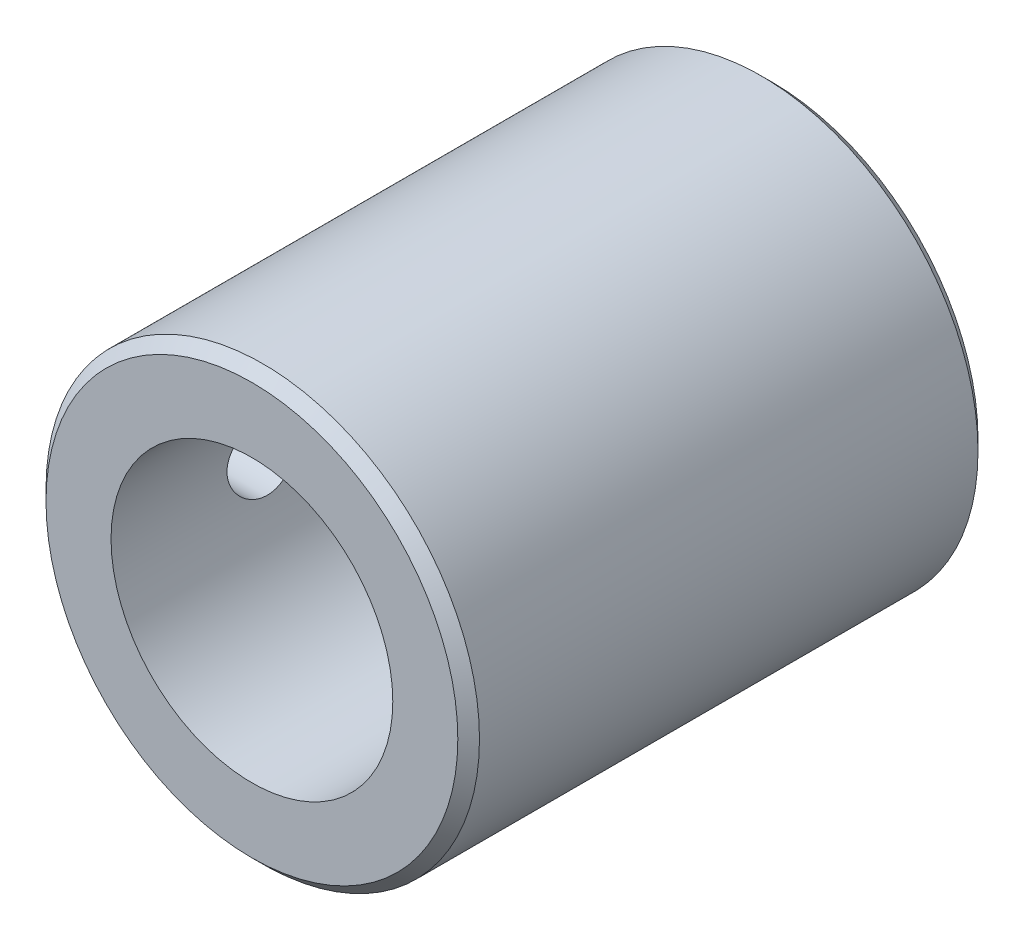
ISO-10303-21;
HEADER;
FILE_DESCRIPTION(('STEP AP214'),'2;1');
FILE_NAME('part.step','',(''),(''),'','','');
FILE_SCHEMA(('AUTOMOTIVE_DESIGN { 1 0 10303 214 1 1 1 1 }'));
ENDSEC;
DATA;
#1=APPLICATION_CONTEXT('core data for automotive mechanical design processes');
#2=APPLICATION_PROTOCOL_DEFINITION('international standard','automotive_design',2000,#1);
#3=PRODUCT_CONTEXT('',#1,'mechanical');
#4=PRODUCT('Part','Part','',(#3));
#5=PRODUCT_RELATED_PRODUCT_CATEGORY('part','',(#4));
#6=PRODUCT_DEFINITION_FORMATION('','',#4);
#7=PRODUCT_DEFINITION_CONTEXT('part definition',#1,'design');
#8=PRODUCT_DEFINITION('design','',#6,#7);
#9=PRODUCT_DEFINITION_SHAPE('','',#8);
#10=(LENGTH_UNIT() NAMED_UNIT(*) SI_UNIT(.MILLI.,.METRE.));
#11=(NAMED_UNIT(*) PLANE_ANGLE_UNIT() SI_UNIT($,.RADIAN.));
#12=(NAMED_UNIT(*) SI_UNIT($,.STERADIAN.) SOLID_ANGLE_UNIT());
#13=UNCERTAINTY_MEASURE_WITH_UNIT(LENGTH_MEASURE(1.E-05),#10,'distance_accuracy_value','');
#14=(GEOMETRIC_REPRESENTATION_CONTEXT(3) GLOBAL_UNCERTAINTY_ASSIGNED_CONTEXT((#13)) GLOBAL_UNIT_ASSIGNED_CONTEXT((#10,
#11,#12)) REPRESENTATION_CONTEXT('',''));
#15=CARTESIAN_POINT('',(0.,0.,0.));
#16=DIRECTION('',(0.,0.,1.));
#17=DIRECTION('',(1.,0.,0.));
#18=AXIS2_PLACEMENT_3D('',#15,#16,#17);
#19=CARTESIAN_POINT('',(0.,0.,9.));
#20=DIRECTION('',(0.,0.,1.));
#21=DIRECTION('',(1.,0.,0.));
#22=AXIS2_PLACEMENT_3D('',#19,#20,#21);
#23=PLANE('',#22);
#24=CARTESIAN_POINT('',(0.,0.,9.));
#25=DIRECTION('',(0.,0.,1.));
#26=DIRECTION('',(1.,0.,0.));
#27=AXIS2_PLACEMENT_3D('',#24,#25,#26);
#28=CIRCLE('',#27,1.7);
#29=CARTESIAN_POINT('',(1.7,0.,9.));
#30=VERTEX_POINT('',#29);
#31=EDGE_CURVE('E129',#30,#30,#28,.T.);
#32=ORIENTED_EDGE('',*,*,#31,.F.);
#33=EDGE_LOOP('',(#32));
#34=FACE_BOUND('',#33,.T.);
#35=CARTESIAN_POINT('',(0.,0.,9.));
#36=DIRECTION('',(0.,0.,1.));
#37=DIRECTION('',(1.,0.,0.));
#38=AXIS2_PLACEMENT_3D('',#35,#36,#37);
#39=CIRCLE('',#38,6.5);
#40=CARTESIAN_POINT('',(5.35847088524704,-3.67923766179351,9.));
#41=VERTEX_POINT('',#40);
#42=CARTESIAN_POINT('',(5.35847088524704,3.67923766179351,9.));
#43=VERTEX_POINT('',#42);
#44=EDGE_CURVE('E85',#41,#43,#39,.T.);
#45=ORIENTED_EDGE('',*,*,#44,.T.);
#46=CARTESIAN_POINT('',(4.24264068711931,4.24264068711926,9.));
#47=DIRECTION('',(0.,0.,1.));
#48=DIRECTION('',(1.,0.,0.));
#49=AXIS2_PLACEMENT_3D('',#46,#47,#48);
#50=CIRCLE('',#49,1.24999999999999);
#51=CARTESIAN_POINT('',(3.67923766179357,5.358470885247,9.));
#52=VERTEX_POINT('',#51);
#53=EDGE_CURVE('E51',#43,#52,#50,.F.);
#54=ORIENTED_EDGE('',*,*,#53,.T.);
#55=CARTESIAN_POINT('',(-3.67923766179353,5.35847088524703,9.));
#56=VERTEX_POINT('',#55);
#57=EDGE_CURVE('E58',#52,#56,#39,.T.);
#58=ORIENTED_EDGE('',*,*,#57,.T.);
#59=CARTESIAN_POINT('',(-4.24264068711928,4.24264068711929,9.));
#60=DIRECTION('',(0.,0.,1.));
#61=DIRECTION('',(1.,0.,0.));
#62=AXIS2_PLACEMENT_3D('',#59,#60,#61);
#63=CIRCLE('',#62,1.24999999999999);
#64=CARTESIAN_POINT('',(-5.35847088524701,3.67923766179355,9.));
#65=VERTEX_POINT('',#64);
#66=EDGE_CURVE('E189',#56,#65,#63,.F.);
#67=ORIENTED_EDGE('',*,*,#66,.T.);
#68=CARTESIAN_POINT('',(-5.35847088524704,-3.67923766179351,9.));
#69=VERTEX_POINT('',#68);
#70=EDGE_CURVE('E87',#65,#69,#39,.T.);
#71=ORIENTED_EDGE('',*,*,#70,.T.);
#72=CARTESIAN_POINT('',(-4.24264068711931,-4.24264068711926,9.));
#73=DIRECTION('',(0.,0.,1.));
#74=DIRECTION('',(1.,0.,0.));
#75=AXIS2_PLACEMENT_3D('',#72,#73,#74);
#76=CIRCLE('',#75,1.24999999999999);
#77=CARTESIAN_POINT('',(-3.67923766179357,-5.358470885247,9.));
#78=VERTEX_POINT('',#77);
#79=EDGE_CURVE('E195',#69,#78,#76,.F.);
#80=ORIENTED_EDGE('',*,*,#79,.T.);
#81=CARTESIAN_POINT('',(3.67923766179357,-5.358470885247,9.));
#82=VERTEX_POINT('',#81);
#83=EDGE_CURVE('E101',#78,#82,#39,.T.);
#84=ORIENTED_EDGE('',*,*,#83,.T.);
#85=CARTESIAN_POINT('',(4.24264068711931,-4.24264068711926,9.));
#86=DIRECTION('',(0.,0.,1.));
#87=DIRECTION('',(1.,0.,0.));
#88=AXIS2_PLACEMENT_3D('',#85,#86,#87);
#89=CIRCLE('',#88,1.24999999999999);
#90=EDGE_CURVE('E123',#82,#41,#89,.F.);
#91=ORIENTED_EDGE('',*,*,#90,.T.);
#92=EDGE_LOOP('',(#45,#54,#58,#67,#71,#80,#84,#91));
#93=FACE_BOUND('',#92,.T.);
#94=ADVANCED_FACE('F37',(#34,#93),#23,.T.);
#95=CARTESIAN_POINT('',(0.,0.,24.));
#96=DIRECTION('',(0.,0.,-1.));
#97=DIRECTION('',(-1.,0.,0.));
#98=AXIS2_PLACEMENT_3D('',#95,#96,#97);
#99=CYLINDRICAL_SURFACE('',#98,10.);
#100=CARTESIAN_POINT('',(0.,0.,0.500000000000014));
#101=DIRECTION('',(0.,0.,1.));
#102=DIRECTION('',(1.,0.,0.));
#103=AXIS2_PLACEMENT_3D('',#100,#101,#102);
#104=CIRCLE('',#103,10.);
#105=CARTESIAN_POINT('',(10.,0.,0.500000000000014));
#106=VERTEX_POINT('',#105);
#107=EDGE_CURVE('E371',#106,#106,#104,.T.);
#108=ORIENTED_EDGE('',*,*,#107,.T.);
#109=EDGE_LOOP('',(#108));
#110=FACE_BOUND('',#109,.T.);
#111=CARTESIAN_POINT('',(0.,0.,23.5));
#112=DIRECTION('',(0.,0.,1.));
#113=DIRECTION('',(1.,0.,0.));
#114=AXIS2_PLACEMENT_3D('',#111,#112,#113);
#115=CIRCLE('',#114,10.);
#116=CARTESIAN_POINT('',(10.,0.,23.5));
#117=VERTEX_POINT('',#116);
#118=EDGE_CURVE('E109',#117,#117,#115,.F.);
#119=ORIENTED_EDGE('',*,*,#118,.T.);
#120=EDGE_LOOP('',(#119));
#121=FACE_BOUND('',#120,.T.);
#122=CARTESIAN_POINT('',(-10.,0.,18.65));
#123=CARTESIAN_POINT('',(-9.99999843258099,-0.0920114531057511,18.6499962990147));
#124=CARTESIAN_POINT('',(-9.99871684765511,-0.184073454347172,18.6422775413146));
#125=CARTESIAN_POINT('',(-9.99372775496381,-0.365616322535329,18.6116187648621));
#126=CARTESIAN_POINT('',(-9.99001800272159,-0.455094721351768,18.5886646630412));
#127=CARTESIAN_POINT('',(-9.98058875631552,-0.628817487751614,18.5282463610641));
#128=CARTESIAN_POINT('',(-9.974870893487,-0.713066038744485,18.4907939364397));
#129=CARTESIAN_POINT('',(-9.96205444853338,-0.874072236504041,18.4024727458514));
#130=CARTESIAN_POINT('',(-9.95495602786423,-0.950830757653328,18.351605548495));
#131=CARTESIAN_POINT('',(-9.9400912001718,-1.09540879372212,18.2373912228671));
#132=CARTESIAN_POINT('',(-9.93231968689365,-1.16314787882339,18.1739429363817));
#133=CARTESIAN_POINT('',(-9.9170237472334,-1.28706950777735,18.0365852264068));
#134=CARTESIAN_POINT('',(-9.90949933632427,-1.34325132909588,17.9626751493568));
#135=CARTESIAN_POINT('',(-9.89550007731641,-1.44278500045253,17.8059406563233));
#136=CARTESIAN_POINT('',(-9.88903182722124,-1.48605749570898,17.7230652056561));
#137=CARTESIAN_POINT('',(-9.87794796970923,-1.55803674048924,17.5510973747635));
#138=CARTESIAN_POINT('',(-9.8733322397089,-1.58674445381556,17.4620054063507));
#139=CARTESIAN_POINT('',(-9.86652679242373,-1.6285261950301,17.280985417999));
#140=CARTESIAN_POINT('',(-9.86431555933323,-1.64173895927951,17.1890902443212));
#141=CARTESIAN_POINT('',(-9.86250435770823,-1.65258585530687,17.0043626340766));
#142=CARTESIAN_POINT('',(-9.86290420804218,-1.65022106770359,16.9115302629694));
#143=CARTESIAN_POINT('',(-9.86625034802632,-1.63009303176277,16.7285527229433));
#144=CARTESIAN_POINT('',(-9.86917088684506,-1.61248549472487,16.6383898859726));
#145=CARTESIAN_POINT('',(-9.87718903199043,-1.56261607367809,16.4623159294666));
#146=CARTESIAN_POINT('',(-9.88228671162733,-1.53035369619838,16.3764049532117));
#147=CARTESIAN_POINT('',(-9.89411264039674,-1.45193210975571,16.2108064700756));
#148=CARTESIAN_POINT('',(-9.90084846298694,-1.4057081060585,16.1311502107593));
#149=CARTESIAN_POINT('',(-9.9151864393107,-1.30072141548377,15.9806656760923));
#150=CARTESIAN_POINT('',(-9.92278866158316,-1.24195773629986,15.9098381000877));
#151=CARTESIAN_POINT('',(-9.93811607123993,-1.11271072676602,15.7781200211173));
#152=CARTESIAN_POINT('',(-9.94584163094155,-1.04209376928223,15.71736060537));
#153=CARTESIAN_POINT('',(-9.96045987838133,-0.891597059898565,15.6085339783937));
#154=CARTESIAN_POINT('',(-9.9673525609492,-0.811717250503356,15.5604668459529));
#155=CARTESIAN_POINT('',(-9.97953794169528,-0.644840083170752,15.4783778494657));
#156=CARTESIAN_POINT('',(-9.98482933722619,-0.557837003156558,15.444367412362));
#157=CARTESIAN_POINT('',(-9.99320544362233,-0.37924693000247,15.3914780872247));
#158=CARTESIAN_POINT('',(-9.99629033536768,-0.287660313260821,15.3725979588552));
#159=CARTESIAN_POINT('',(-9.99988156603306,-0.103632983819161,15.3506825388388));
#160=CARTESIAN_POINT('',(-10.0004171933872,-0.0112142564118355,15.3474672638785));
#161=CARTESIAN_POINT('',(-9.99892971175882,0.172841505554681,15.3564931986803));
#162=CARTESIAN_POINT('',(-9.99690669920295,0.264478569441163,15.3687338259605));
#163=CARTESIAN_POINT('',(-9.99054737820398,0.443814955541769,15.4081744027771));
#164=CARTESIAN_POINT('',(-9.98622483070291,0.531534371938301,15.4352853943084));
#165=CARTESIAN_POINT('',(-9.97574921956607,0.701182959294592,15.5036023925551));
#166=CARTESIAN_POINT('',(-9.96959605484327,0.783111810188988,15.5448091776617));
#167=CARTESIAN_POINT('',(-9.95606928426946,0.93963639887725,15.640561319499));
#168=CARTESIAN_POINT('',(-9.94868555427359,1.01416235726447,15.6952192859171));
#169=CARTESIAN_POINT('',(-9.93354765732487,1.15304841333208,15.8161671490688));
#170=CARTESIAN_POINT('',(-9.92579346406183,1.21740778758216,15.8824578728543));
#171=CARTESIAN_POINT('',(-9.91069407401676,1.33479962911472,16.0255961063283));
#172=CARTESIAN_POINT('',(-9.90335382329476,1.38771058951943,16.1025438710988));
#173=CARTESIAN_POINT('',(-9.89000528724129,1.47985547415616,16.2643410470675));
#174=CARTESIAN_POINT('',(-9.88399696030451,1.51908982562647,16.3491902113319));
#175=CARTESIAN_POINT('',(-9.87402953570153,1.58258535747086,16.5240395324032));
#176=CARTESIAN_POINT('',(-9.87006212213643,1.60690737863649,16.6140170997967));
#177=CARTESIAN_POINT('',(-9.86460473721113,1.64007952798875,16.7968513117806));
#178=CARTESIAN_POINT('',(-9.86311455516768,1.64893097191818,16.8897077108482));
#179=CARTESIAN_POINT('',(-9.86278931217107,1.65087457438795,17.0744506413018));
#180=CARTESIAN_POINT('',(-9.86392203182987,1.64415796786953,17.1663351601921));
#181=CARTESIAN_POINT('',(-9.86864441177183,1.61556925478546,17.3476477518639));
#182=CARTESIAN_POINT('',(-9.87223406454433,1.59369719454886,17.4370758321536));
#183=CARTESIAN_POINT('',(-9.88145370519205,1.53549112071356,17.6108652424354));
#184=CARTESIAN_POINT('',(-9.88708141498759,1.49917324977365,17.695232107451));
#185=CARTESIAN_POINT('',(-9.89974533231771,1.41312606218934,17.8567062668603));
#186=CARTESIAN_POINT('',(-9.90678160742252,1.36339610211421,17.9338132127277));
#187=CARTESIAN_POINT('',(-9.92157214136343,1.25125259966706,18.0795454976377));
#188=CARTESIAN_POINT('',(-9.92933379899765,1.18869826623126,18.1480617598196));
#189=CARTESIAN_POINT('',(-9.94464125601211,1.05297867490409,18.2736905998768));
#190=CARTESIAN_POINT('',(-9.95218700513286,0.97981097009267,18.3308005407802));
#191=CARTESIAN_POINT('',(-9.96627143049842,0.824354696103046,18.4323474225735));
#192=CARTESIAN_POINT('',(-9.97280295936929,0.742007852048188,18.476696147978));
#193=CARTESIAN_POINT('',(-9.98405342047581,0.570959586923796,18.5508633528063));
#194=CARTESIAN_POINT('',(-9.98877416450827,0.482264623543763,18.5806963641252));
#195=CARTESIAN_POINT('',(-9.99483601455804,0.327682758240928,18.6184793415268));
#196=CARTESIAN_POINT('',(-9.99676220083327,0.2627330667111,18.6302807488145));
#197=CARTESIAN_POINT('',(-9.99934474465587,0.131864227625941,18.6460423389331));
#198=CARTESIAN_POINT('',(-10.0000011233775,0.0659450962546689,18.6500026525158));
#199=CARTESIAN_POINT('',(-10.,0.,18.65));
#200=B_SPLINE_CURVE_WITH_KNOTS('',3,(#122,#123,#124,#125,#126,#127,#128,#129,#130,#131,#132,
#133,#134,#135,#136,#137,#138,#139,#140,#141,#142,#143,#144,#145,#146,#147,#148,#149,#150,#151,
#152,#153,#154,#155,#156,#157,#158,#159,#160,#161,#162,#163,#164,#165,#166,#167,#168,#169,#170,
#171,#172,#173,#174,#175,#176,#177,#178,#179,#180,#181,#182,#183,#184,#185,#186,#187,#188,#189,
#190,#191,#192,#193,#194,#195,#196,#197,#198,#199),.UNSPECIFIED.,.T.,.F.,(4,2,2,2,2,2,2,2,2,2,2,
2,2,2,2,2,2,2,2,2,2,2,2,2,2,2,2,2,2,2,2,2,2,2,2,2,2,2,4),(0.,0.275793319008917,
0.551841928312973,0.827666799870599,1.1034594331417,1.38156673144315,1.65969141110741,
1.93949209608633,2.21927426326045,2.49653175525206,2.77377001402269,3.04820914252877,
3.32265751287872,3.59839967320042,3.87416366201707,4.1532757240192,4.43238951858747,
4.71172976565332,4.99104711092801,5.26714751096617,5.5432375060019,5.81769359979004,
6.09216485190803,6.36901711215386,6.64588906369258,6.92556925596459,7.20524071063228,
7.48376340648033,7.76226241335696,8.03735855216244,8.31245385002402,8.58724259883659,
8.86204453269316,9.14004258759617,9.41810483731131,9.69804546871318,9.97770526783281,
10.1753710978727,10.3730336317698),.UNSPECIFIED.);
#201=CARTESIAN_POINT('',(-10.,0.,18.65));
#202=VERTEX_POINT('',#201);
#203=EDGE_CURVE('E105',#202,#202,#200,.T.);
#204=ORIENTED_EDGE('',*,*,#203,.T.);
#205=EDGE_LOOP('',(#204));
#206=FACE_BOUND('',#205,.T.);
#207=ADVANCED_FACE('F131',(#110,#121,#206),#99,.T.);
#208=CARTESIAN_POINT('',(0.,0.,24.));
#209=DIRECTION('',(0.,0.,1.));
#210=DIRECTION('',(1.,0.,0.));
#211=AXIS2_PLACEMENT_3D('',#208,#209,#210);
#212=PLANE('',#211);
#213=CARTESIAN_POINT('',(0.,0.,24.));
#214=DIRECTION('',(0.,0.,1.));
#215=DIRECTION('',(1.,0.,0.));
#216=AXIS2_PLACEMENT_3D('',#213,#214,#215);
#217=CIRCLE('',#216,9.5);
#218=CARTESIAN_POINT('',(9.5,0.,24.));
#219=VERTEX_POINT('',#218);
#220=EDGE_CURVE('E11',#219,#219,#217,.T.);
#221=ORIENTED_EDGE('',*,*,#220,.T.);
#222=EDGE_LOOP('',(#221));
#223=FACE_BOUND('',#222,.T.);
#224=CARTESIAN_POINT('',(0.,0.,24.));
#225=DIRECTION('',(0.,0.,1.));
#226=DIRECTION('',(1.,0.,0.));
#227=AXIS2_PLACEMENT_3D('',#224,#225,#226);
#228=CIRCLE('',#227,6.5);
#229=CARTESIAN_POINT('',(6.5,0.,24.));
#230=VERTEX_POINT('',#229);
#231=EDGE_CURVE('E116',#230,#230,#228,.T.);
#232=ORIENTED_EDGE('',*,*,#231,.F.);
#233=EDGE_LOOP('',(#232));
#234=FACE_BOUND('',#233,.T.);
#235=ADVANCED_FACE('F154',(#223,#234),#212,.T.);
#236=CARTESIAN_POINT('',(0.,0.,0.));
#237=DIRECTION('',(0.,0.,1.));
#238=DIRECTION('',(1.,0.,0.));
#239=AXIS2_PLACEMENT_3D('',#236,#237,#238);
#240=PLANE('',#239);
#241=CARTESIAN_POINT('',(0.,0.,0.));
#242=DIRECTION('',(0.,0.,1.));
#243=DIRECTION('',(1.,0.,0.));
#244=AXIS2_PLACEMENT_3D('',#241,#242,#243);
#245=CIRCLE('',#244,9.49999999999999);
#246=CARTESIAN_POINT('',(9.49999999999999,0.,0.));
#247=VERTEX_POINT('',#246);
#248=EDGE_CURVE('E45',#247,#247,#245,.F.);
#249=ORIENTED_EDGE('',*,*,#248,.T.);
#250=EDGE_LOOP('',(#249));
#251=FACE_BOUND('',#250,.T.);
#252=CARTESIAN_POINT('',(0.,0.,0.));
#253=DIRECTION('',(0.,0.,-1.));
#254=DIRECTION('',(-1.,0.,0.));
#255=AXIS2_PLACEMENT_3D('',#252,#253,#254);
#256=CIRCLE('',#255,3.35);
#257=CARTESIAN_POINT('',(-3.35,0.,0.));
#258=VERTEX_POINT('',#257);
#259=EDGE_CURVE('E183',#258,#258,#256,.T.);
#260=ORIENTED_EDGE('',*,*,#259,.F.);
#261=EDGE_LOOP('',(#260));
#262=FACE_BOUND('',#261,.T.);
#263=CARTESIAN_POINT('',(4.24264068711931,4.24264068711926,0.));
#264=DIRECTION('',(0.,0.,-1.));
#265=DIRECTION('',(-1.,0.,0.));
#266=AXIS2_PLACEMENT_3D('',#263,#264,#265);
#267=CIRCLE('',#266,1.24999999999999);
#268=CARTESIAN_POINT('',(2.99264068711932,4.24264068711926,0.));
#269=VERTEX_POINT('',#268);
#270=EDGE_CURVE('E90',#269,#269,#267,.T.);
#271=ORIENTED_EDGE('',*,*,#270,.F.);
#272=EDGE_LOOP('',(#271));
#273=FACE_BOUND('',#272,.T.);
#274=CARTESIAN_POINT('',(-4.24264068711928,4.24264068711929,0.));
#275=DIRECTION('',(0.,0.,-1.));
#276=DIRECTION('',(-1.,0.,0.));
#277=AXIS2_PLACEMENT_3D('',#274,#275,#276);
#278=CIRCLE('',#277,1.24999999999999);
#279=CARTESIAN_POINT('',(-5.49264068711927,4.24264068711929,0.));
#280=VERTEX_POINT('',#279);
#281=EDGE_CURVE('E93',#280,#280,#278,.T.);
#282=ORIENTED_EDGE('',*,*,#281,.F.);
#283=EDGE_LOOP('',(#282));
#284=FACE_BOUND('',#283,.T.);
#285=CARTESIAN_POINT('',(-4.24264068711931,-4.24264068711926,0.));
#286=DIRECTION('',(0.,0.,-1.));
#287=DIRECTION('',(-1.,0.,0.));
#288=AXIS2_PLACEMENT_3D('',#285,#286,#287);
#289=CIRCLE('',#288,1.24999999999999);
#290=CARTESIAN_POINT('',(-5.4926406871193,-4.24264068711926,0.));
#291=VERTEX_POINT('',#290);
#292=EDGE_CURVE('E192',#291,#291,#289,.T.);
#293=ORIENTED_EDGE('',*,*,#292,.F.);
#294=EDGE_LOOP('',(#293));
#295=FACE_BOUND('',#294,.T.);
#296=CARTESIAN_POINT('',(4.24264068711931,-4.24264068711926,0.));
#297=DIRECTION('',(0.,0.,-1.));
#298=DIRECTION('',(-1.,0.,0.));
#299=AXIS2_PLACEMENT_3D('',#296,#297,#298);
#300=CIRCLE('',#299,1.24999999999999);
#301=CARTESIAN_POINT('',(2.99264068711932,-4.24264068711926,0.));
#302=VERTEX_POINT('',#301);
#303=EDGE_CURVE('E197',#302,#302,#300,.T.);
#304=ORIENTED_EDGE('',*,*,#303,.F.);
#305=EDGE_LOOP('',(#304));
#306=FACE_BOUND('',#305,.T.);
#307=ADVANCED_FACE('F152',(#251,#262,#273,#284,#295,#306),#240,.F.);
#308=CARTESIAN_POINT('',(0.,0.,9.));
#309=DIRECTION('',(0.,0.,1.));
#310=DIRECTION('',(1.,0.,0.));
#311=AXIS2_PLACEMENT_3D('',#308,#309,#310);
#312=CYLINDRICAL_SURFACE('',#311,6.5);
#313=CARTESIAN_POINT('',(-6.5,0.,18.65));
#314=CARTESIAN_POINT('',(-6.49999849148033,0.0911177503858731,18.6499975271443));
#315=CARTESIAN_POINT('',(-6.4980650151015,0.182262858095387,18.6424269510268));
#316=CARTESIAN_POINT('',(-6.49053943796148,0.361937820756668,18.6123918810941));
#317=CARTESIAN_POINT('',(-6.48494533438108,0.450466216312033,18.5899192338991));
#318=CARTESIAN_POINT('',(-6.47071750795578,0.622287397419873,18.5308498534362));
#319=CARTESIAN_POINT('',(-6.46208749750639,0.705586431636939,18.4942703651899));
#320=CARTESIAN_POINT('',(-6.44270535969817,0.864866150834567,18.4080870708407));
#321=CARTESIAN_POINT('',(-6.43195314475064,0.940846533563351,18.3584827271415));
#322=CARTESIAN_POINT('',(-6.40923777941342,1.08494165624619,18.2465480115112));
#323=CARTESIAN_POINT('',(-6.39725548483155,1.15287927915147,18.1839935093819));
#324=CARTESIAN_POINT('',(-6.37355665387331,1.2774205628457,18.0484138634561));
#325=CARTESIAN_POINT('',(-6.36184014855969,1.33402290487283,17.9753875030435));
#326=CARTESIAN_POINT('',(-6.33980584668286,1.43512676812558,17.8195531706555));
#327=CARTESIAN_POINT('',(-6.32951232072087,1.47942889215842,17.7366120872206));
#328=CARTESIAN_POINT('',(-6.31176915976443,1.55339199639589,17.5641559394432));
#329=CARTESIAN_POINT('',(-6.3043190546097,1.58305539735461,17.4746419648511));
#330=CARTESIAN_POINT('',(-6.29330322679464,1.62629233475194,17.2935317839025));
#331=CARTESIAN_POINT('',(-6.28966059809192,1.64018493928543,17.2020165371914));
#332=CARTESIAN_POINT('',(-6.28644204901193,1.65247997744377,17.0178874125951));
#333=CARTESIAN_POINT('',(-6.28686544513413,1.65088501453495,16.9252737219731));
#334=CARTESIAN_POINT('',(-6.29166204403964,1.63250447801232,16.74403211902));
#335=CARTESIAN_POINT('',(-6.29593604050051,1.61610042228528,16.6553624779331));
#336=CARTESIAN_POINT('',(-6.30779399869364,1.56917650684075,16.482076866203));
#337=CARTESIAN_POINT('',(-6.31537820273062,1.53865561377152,16.3974611928105));
#338=CARTESIAN_POINT('',(-6.33309221869858,1.46404250493563,16.233668872872));
#339=CARTESIAN_POINT('',(-6.34324760249032,1.41981289361812,16.154557696682));
#340=CARTESIAN_POINT('',(-6.364945442261,1.31913389984381,16.0047439402814));
#341=CARTESIAN_POINT('',(-6.37648814769664,1.26268231826682,15.9340428768687));
#342=CARTESIAN_POINT('',(-6.40007669661782,1.13719136135146,15.8008714139835));
#343=CARTESIAN_POINT('',(-6.41212734929307,1.06783038255625,15.7387045308094));
#344=CARTESIAN_POINT('',(-6.43506800190513,0.919522532515226,15.6268261884887));
#345=CARTESIAN_POINT('',(-6.4459579641844,0.840575350431436,15.5771151333895));
#346=CARTESIAN_POINT('',(-6.4654072019095,0.674894732770334,15.4914431523107));
#347=CARTESIAN_POINT('',(-6.47395787369381,0.588134074053323,15.4555327930044));
#348=CARTESIAN_POINT('',(-6.48770263023884,0.409541718403765,15.3988920585116));
#349=CARTESIAN_POINT('',(-6.49289737755419,0.317711026327973,15.3781586868498));
#350=CARTESIAN_POINT('',(-6.49924644511166,0.134179279177317,15.3529269360867));
#351=CARTESIAN_POINT('',(-6.5005035683198,0.0425384989604849,15.3480153835219));
#352=CARTESIAN_POINT('',(-6.4991291685556,-0.140255983188985,15.353431707465));
#353=CARTESIAN_POINT('',(-6.49649800722503,-0.231409729628336,15.3637581667149));
#354=CARTESIAN_POINT('',(-6.48770867929811,-0.409198092309223,15.3990171731005));
#355=CARTESIAN_POINT('',(-6.48160524971031,-0.495880588598902,15.4237231766394));
#356=CARTESIAN_POINT('',(-6.46656022798463,-0.663865402904555,15.4867802242886));
#357=CARTESIAN_POINT('',(-6.45761834418719,-0.745167166996456,15.5251326706602));
#358=CARTESIAN_POINT('',(-6.4376432610754,-0.901717887469288,15.6151868784053));
#359=CARTESIAN_POINT('',(-6.42657501104735,-0.976830003962306,15.6671185596132));
#360=CARTESIAN_POINT('',(-6.40362831883756,-1.11741986610505,15.7825643066315));
#361=CARTESIAN_POINT('',(-6.39174973250325,-1.18289589099313,15.8460804366069));
#362=CARTESIAN_POINT('',(-6.36814923136526,-1.30406635448273,15.9848128318325));
#363=CARTESIAN_POINT('',(-6.35643893296219,-1.35947055793743,16.0602850051769));
#364=CARTESIAN_POINT('',(-6.33483594517711,-1.45682878188372,16.2196981261065));
#365=CARTESIAN_POINT('',(-6.32494317580465,-1.49878339435969,16.3036387007409));
#366=CARTESIAN_POINT('',(-6.30820564851897,-1.56773755394613,16.4771608999336));
#367=CARTESIAN_POINT('',(-6.30134291296739,-1.59482554658986,16.566705552564));
#368=CARTESIAN_POINT('',(-6.29142787777632,-1.63350588726022,16.7492797142624));
#369=CARTESIAN_POINT('',(-6.28837471379837,-1.64510175027641,16.8423084279103));
#370=CARTESIAN_POINT('',(-6.28649183842141,-1.65228074681225,17.0262525782131));
#371=CARTESIAN_POINT('',(-6.28753962152452,-1.64832832798558,17.1171489199998));
#372=CARTESIAN_POINT('',(-6.29345653429825,-1.62558916594653,17.2969334908211));
#373=CARTESIAN_POINT('',(-6.29832558250899,-1.60680273895831,17.3858217626213));
#374=CARTESIAN_POINT('',(-6.31126706173436,-1.55518610871843,17.5585440684628));
#375=CARTESIAN_POINT('',(-6.31931901702728,-1.522445569368,17.6424065380379));
#376=CARTESIAN_POINT('',(-6.3377213707967,-1.44392066335697,17.8035088724099));
#377=CARTESIAN_POINT('',(-6.34807209772023,-1.3981344324715,17.8807477886496));
#378=CARTESIAN_POINT('',(-6.37025290066772,-1.29337273284388,18.0286486942442));
#379=CARTESIAN_POINT('',(-6.38211523105464,-1.23407618889246,18.0990784573145));
#380=CARTESIAN_POINT('',(-6.40579298687251,-1.104599377756,18.2291390142026));
#381=CARTESIAN_POINT('',(-6.41760840043669,-1.03441651710484,18.2887672273912));
#382=CARTESIAN_POINT('',(-6.44012670826218,-0.883564094524524,18.3966290836568));
#383=CARTESIAN_POINT('',(-6.45080446058256,-0.802721933411487,18.4446269911767));
#384=CARTESIAN_POINT('',(-6.46957701766543,-0.633851244249663,18.526274811358));
#385=CARTESIAN_POINT('',(-6.47767362922087,-0.545827797531963,18.5599347661284));
#386=CARTESIAN_POINT('',(-6.48920819390174,-0.381665270886312,18.6070903673807));
#387=CARTESIAN_POINT('',(-6.49322694643271,-0.306292143202488,18.62314612518));
#388=CARTESIAN_POINT('',(-6.49862338093772,-0.153952434713927,18.6446015591842));
#389=CARTESIAN_POINT('',(-6.50000127455811,-0.076985982102799,18.650002089332));
#390=CARTESIAN_POINT('',(-6.5,0.,18.65));
#391=B_SPLINE_CURVE_WITH_KNOTS('',3,(#313,#314,#315,#316,#317,#318,#319,#320,#321,#322,#323,
#324,#325,#326,#327,#328,#329,#330,#331,#332,#333,#334,#335,#336,#337,#338,#339,#340,#341,#342,
#343,#344,#345,#346,#347,#348,#349,#350,#351,#352,#353,#354,#355,#356,#357,#358,#359,#360,#361,
#362,#363,#364,#365,#366,#367,#368,#369,#370,#371,#372,#373,#374,#375,#376,#377,#378,#379,#380,
#381,#382,#383,#384,#385,#386,#387,#388,#389,#390),.UNSPECIFIED.,.T.,.F.,(4,2,2,2,2,2,2,2,2,2,2,
2,2,2,2,2,2,2,2,2,2,2,2,2,2,2,2,2,2,2,2,2,2,2,2,2,2,2,4),(0.,0.273071080673042,
0.546291690312233,0.819179352572715,1.09207827994795,1.37016840025652,1.64829085517239,
1.93068877591831,2.21303998185288,2.48957086262239,2.76605525924413,3.03561386213348,
3.30519219982155,3.5775648784331,3.84998660632107,4.13042684673474,4.41087618300893,
4.69234352388222,4.97375527812577,5.24775597584741,5.52173119090107,5.7915025937798,
6.06130172544543,6.33600366696576,6.61075460391991,6.89247457814753,7.17418215075422,
7.45419508187937,7.73414447043176,8.00579583650453,8.27744141180216,8.54736720344426,
8.81733158675163,9.09454331866244,9.37182119292242,9.65432089037336,9.93662240220948,
10.167360433645,10.398079972269),.UNSPECIFIED.);
#392=CARTESIAN_POINT('',(-6.5,0.,18.65));
#393=VERTEX_POINT('',#392);
#394=EDGE_CURVE('E120',#393,#393,#391,.T.);
#395=ORIENTED_EDGE('',*,*,#394,.T.);
#396=EDGE_LOOP('',(#395));
#397=FACE_BOUND('',#396,.T.);
#398=EDGE_CURVE('E100',#82,#41,#39,.T.);
#399=ORIENTED_EDGE('',*,*,#398,.F.);
#400=ORIENTED_EDGE('',*,*,#83,.F.);
#401=EDGE_CURVE('E111',#69,#78,#39,.T.);
#402=ORIENTED_EDGE('',*,*,#401,.F.);
#403=ORIENTED_EDGE('',*,*,#70,.F.);
#404=EDGE_CURVE('E99',#56,#65,#39,.T.);
#405=ORIENTED_EDGE('',*,*,#404,.F.);
#406=ORIENTED_EDGE('',*,*,#57,.F.);
#407=EDGE_CURVE('E79',#43,#52,#39,.T.);
#408=ORIENTED_EDGE('',*,*,#407,.F.);
#409=ORIENTED_EDGE('',*,*,#44,.F.);
#410=EDGE_LOOP('',(#399,#400,#402,#403,#405,#406,#408,#409));
#411=FACE_BOUND('',#410,.T.);
#412=ORIENTED_EDGE('',*,*,#231,.T.);
#413=EDGE_LOOP('',(#412));
#414=FACE_BOUND('',#413,.T.);
#415=ADVANCED_FACE('F96',(#397,#411,#414),#312,.F.);
#416=CARTESIAN_POINT('',(-10.,0.,17.));
#417=DIRECTION('',(-1.,0.,0.));
#418=DIRECTION('',(0.,0.,1.));
#419=AXIS2_PLACEMENT_3D('',#416,#417,#418);
#420=CYLINDRICAL_SURFACE('',#419,1.64999999999999);
#421=ORIENTED_EDGE('',*,*,#203,.F.);
#422=EDGE_LOOP('',(#421));
#423=FACE_BOUND('',#422,.T.);
#424=ORIENTED_EDGE('',*,*,#394,.F.);
#425=EDGE_LOOP('',(#424));
#426=FACE_BOUND('',#425,.T.);
#427=ADVANCED_FACE('F134',(#423,#426),#420,.F.);
#428=CARTESIAN_POINT('',(4.24264068711931,-4.24264068711926,0.));
#429=DIRECTION('',(0.,0.,-1.));
#430=DIRECTION('',(-1.,0.,0.));
#431=AXIS2_PLACEMENT_3D('',#428,#429,#430);
#432=CYLINDRICAL_SURFACE('',#431,1.24999999999999);
#433=ORIENTED_EDGE('',*,*,#90,.F.);
#434=EDGE_CURVE('E199',#41,#82,#89,.F.);
#435=ORIENTED_EDGE('',*,*,#434,.F.);
#436=EDGE_LOOP('',(#433,#435));
#437=FACE_BOUND('',#436,.T.);
#438=ORIENTED_EDGE('',*,*,#303,.T.);
#439=EDGE_LOOP('',(#438));
#440=FACE_BOUND('',#439,.T.);
#441=ADVANCED_FACE('F139',(#437,#440),#432,.F.);
#442=CARTESIAN_POINT('',(0.,0.,9.));
#443=DIRECTION('',(0.,0.,1.));
#444=DIRECTION('',(1.,0.,0.));
#445=AXIS2_PLACEMENT_3D('',#442,#443,#444);
#446=PLANE('',#445);
#447=ORIENTED_EDGE('',*,*,#398,.T.);
#448=ORIENTED_EDGE('',*,*,#434,.T.);
#449=EDGE_LOOP('',(#447,#448));
#450=FACE_BOUND('',#449,.T.);
#451=ADVANCED_FACE('F141',(#450),#446,.F.);
#452=CARTESIAN_POINT('',(0.,0.,9.));
#453=DIRECTION('',(0.,0.,1.));
#454=DIRECTION('',(1.,0.,0.));
#455=AXIS2_PLACEMENT_3D('',#452,#453,#454);
#456=PLANE('',#455);
#457=EDGE_CURVE('E196',#78,#69,#76,.F.);
#458=ORIENTED_EDGE('',*,*,#457,.T.);
#459=ORIENTED_EDGE('',*,*,#401,.T.);
#460=EDGE_LOOP('',(#458,#459));
#461=FACE_BOUND('',#460,.T.);
#462=ADVANCED_FACE('F206',(#461),#456,.F.);
#463=CARTESIAN_POINT('',(-4.24264068711931,-4.24264068711926,0.));
#464=DIRECTION('',(0.,0.,-1.));
#465=DIRECTION('',(-1.,0.,0.));
#466=AXIS2_PLACEMENT_3D('',#463,#464,#465);
#467=CYLINDRICAL_SURFACE('',#466,1.24999999999999);
#468=ORIENTED_EDGE('',*,*,#457,.F.);
#469=ORIENTED_EDGE('',*,*,#79,.F.);
#470=EDGE_LOOP('',(#468,#469));
#471=FACE_BOUND('',#470,.T.);
#472=ORIENTED_EDGE('',*,*,#292,.T.);
#473=EDGE_LOOP('',(#472));
#474=FACE_BOUND('',#473,.T.);
#475=ADVANCED_FACE('F208',(#471,#474),#467,.F.);
#476=CARTESIAN_POINT('',(0.,0.,9.));
#477=DIRECTION('',(0.,0.,1.));
#478=DIRECTION('',(1.,0.,0.));
#479=AXIS2_PLACEMENT_3D('',#476,#477,#478);
#480=PLANE('',#479);
#481=EDGE_CURVE('E190',#65,#56,#63,.F.);
#482=ORIENTED_EDGE('',*,*,#481,.T.);
#483=ORIENTED_EDGE('',*,*,#404,.T.);
#484=EDGE_LOOP('',(#482,#483));
#485=FACE_BOUND('',#484,.T.);
#486=ADVANCED_FACE('F211',(#485),#480,.F.);
#487=CARTESIAN_POINT('',(-4.24264068711928,4.24264068711929,0.));
#488=DIRECTION('',(0.,0.,-1.));
#489=DIRECTION('',(-1.,0.,0.));
#490=AXIS2_PLACEMENT_3D('',#487,#488,#489);
#491=CYLINDRICAL_SURFACE('',#490,1.24999999999999);
#492=ORIENTED_EDGE('',*,*,#481,.F.);
#493=ORIENTED_EDGE('',*,*,#66,.F.);
#494=EDGE_LOOP('',(#492,#493));
#495=FACE_BOUND('',#494,.T.);
#496=ORIENTED_EDGE('',*,*,#281,.T.);
#497=EDGE_LOOP('',(#496));
#498=FACE_BOUND('',#497,.T.);
#499=ADVANCED_FACE('F220',(#495,#498),#491,.F.);
#500=CARTESIAN_POINT('',(0.,0.,9.));
#501=DIRECTION('',(0.,0.,1.));
#502=DIRECTION('',(1.,0.,0.));
#503=AXIS2_PLACEMENT_3D('',#500,#501,#502);
#504=PLANE('',#503);
#505=EDGE_CURVE('E81',#52,#43,#50,.F.);
#506=ORIENTED_EDGE('',*,*,#505,.T.);
#507=ORIENTED_EDGE('',*,*,#407,.T.);
#508=EDGE_LOOP('',(#506,#507));
#509=FACE_BOUND('',#508,.T.);
#510=ADVANCED_FACE('F80',(#509),#504,.F.);
#511=CARTESIAN_POINT('',(4.24264068711931,4.24264068711926,0.));
#512=DIRECTION('',(0.,0.,-1.));
#513=DIRECTION('',(-1.,0.,0.));
#514=AXIS2_PLACEMENT_3D('',#511,#512,#513);
#515=CYLINDRICAL_SURFACE('',#514,1.24999999999999);
#516=ORIENTED_EDGE('',*,*,#53,.F.);
#517=ORIENTED_EDGE('',*,*,#505,.F.);
#518=EDGE_LOOP('',(#516,#517));
#519=FACE_BOUND('',#518,.T.);
#520=ORIENTED_EDGE('',*,*,#270,.T.);
#521=EDGE_LOOP('',(#520));
#522=FACE_BOUND('',#521,.T.);
#523=ADVANCED_FACE('F88',(#519,#522),#515,.F.);
#524=CARTESIAN_POINT('',(0.,0.,0.));
#525=DIRECTION('',(0.,0.,-1.));
#526=DIRECTION('',(-1.,0.,0.));
#527=AXIS2_PLACEMENT_3D('',#524,#525,#526);
#528=CYLINDRICAL_SURFACE('',#527,1.7);
#529=ORIENTED_EDGE('',*,*,#31,.T.);
#530=EDGE_LOOP('',(#529));
#531=FACE_BOUND('',#530,.T.);
#532=CARTESIAN_POINT('',(0.,0.,6.));
#533=DIRECTION('',(0.,0.,-1.));
#534=DIRECTION('',(-1.,0.,0.));
#535=AXIS2_PLACEMENT_3D('',#532,#533,#534);
#536=CIRCLE('',#535,1.7);
#537=CARTESIAN_POINT('',(-1.7,0.,6.));
#538=VERTEX_POINT('',#537);
#539=EDGE_CURVE('E174',#538,#538,#536,.T.);
#540=ORIENTED_EDGE('',*,*,#539,.T.);
#541=EDGE_LOOP('',(#540));
#542=FACE_BOUND('',#541,.T.);
#543=ADVANCED_FACE('F274',(#531,#542),#528,.F.);
#544=CARTESIAN_POINT('',(1.7,0.,6.));
#545=DIRECTION('',(0.,0.,1.));
#546=DIRECTION('',(1.,0.,0.));
#547=AXIS2_PLACEMENT_3D('',#544,#545,#546);
#548=PLANE('',#547);
#549=ORIENTED_EDGE('',*,*,#539,.F.);
#550=EDGE_LOOP('',(#549));
#551=FACE_BOUND('',#550,.T.);
#552=CARTESIAN_POINT('',(0.,0.,6.));
#553=DIRECTION('',(0.,0.,-1.));
#554=DIRECTION('',(-1.,0.,0.));
#555=AXIS2_PLACEMENT_3D('',#552,#553,#554);
#556=CIRCLE('',#555,3.35);
#557=CARTESIAN_POINT('',(-3.35,0.,6.));
#558=VERTEX_POINT('',#557);
#559=EDGE_CURVE('E178',#558,#558,#556,.T.);
#560=ORIENTED_EDGE('',*,*,#559,.T.);
#561=EDGE_LOOP('',(#560));
#562=FACE_BOUND('',#561,.T.);
#563=ADVANCED_FACE('F291',(#551,#562),#548,.F.);
#564=CARTESIAN_POINT('',(0.,0.,0.));
#565=DIRECTION('',(0.,0.,-1.));
#566=DIRECTION('',(-1.,0.,0.));
#567=AXIS2_PLACEMENT_3D('',#564,#565,#566);
#568=CYLINDRICAL_SURFACE('',#567,3.35);
#569=ORIENTED_EDGE('',*,*,#559,.F.);
#570=EDGE_LOOP('',(#569));
#571=FACE_BOUND('',#570,.T.);
#572=ORIENTED_EDGE('',*,*,#259,.T.);
#573=EDGE_LOOP('',(#572));
#574=FACE_BOUND('',#573,.T.);
#575=ADVANCED_FACE('F300',(#571,#574),#568,.F.);
#576=CARTESIAN_POINT('',(0.,0.,0.500000000000014));
#577=DIRECTION('',(0.,0.,1.));
#578=DIRECTION('',(1.,0.,0.));
#579=AXIS2_PLACEMENT_3D('',#576,#577,#578);
#580=CONICAL_SURFACE('',#579,10.,0.785398163397443);
#581=ORIENTED_EDGE('',*,*,#248,.F.);
#582=EDGE_LOOP('',(#581));
#583=FACE_BOUND('',#582,.T.);
#584=ORIENTED_EDGE('',*,*,#107,.F.);
#585=EDGE_LOOP('',(#584));
#586=FACE_BOUND('',#585,.T.);
#587=ADVANCED_FACE('F309',(#583,#586),#580,.T.);
#588=CARTESIAN_POINT('',(0.,0.,24.));
#589=DIRECTION('',(0.,0.,-1.));
#590=DIRECTION('',(-1.,0.,0.));
#591=AXIS2_PLACEMENT_3D('',#588,#589,#590);
#592=CONICAL_SURFACE('',#591,9.5,0.78539816339744);
#593=ORIENTED_EDGE('',*,*,#118,.F.);
#594=EDGE_LOOP('',(#593));
#595=FACE_BOUND('',#594,.T.);
#596=ORIENTED_EDGE('',*,*,#220,.F.);
#597=EDGE_LOOP('',(#596));
#598=FACE_BOUND('',#597,.T.);
#599=ADVANCED_FACE('F39',(#595,#598),#592,.T.);
#600=CLOSED_SHELL('',(#94,#207,#235,#307,#415,#427,#441,#451,#462,#475,#486,#499,#510,#523,#543,
#563,#575,#587,#599));
#601=MANIFOLD_SOLID_BREP('B2',#600);
#602=ADVANCED_BREP_SHAPE_REPRESENTATION('',(#18,#601),#14);
#603=SHAPE_DEFINITION_REPRESENTATION(#9,#602);
ENDSEC;
END-ISO-10303-21;
